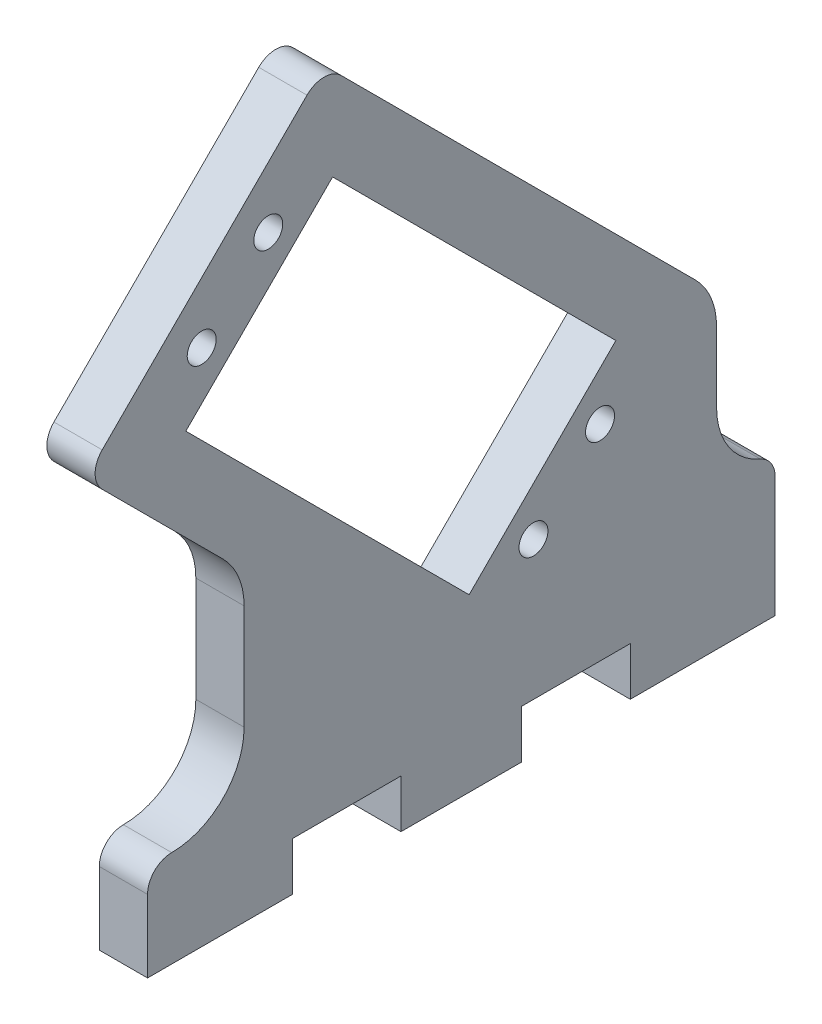
ISO-10303-21;
HEADER;
FILE_DESCRIPTION(('STEP AP214'),'2;1');
FILE_NAME('part.step','',(''),(''),'','','');
FILE_SCHEMA(('AUTOMOTIVE_DESIGN { 1 0 10303 214 1 1 1 1 }'));
ENDSEC;
DATA;
#1=APPLICATION_CONTEXT('core data for automotive mechanical design processes');
#2=APPLICATION_PROTOCOL_DEFINITION('international standard','automotive_design',2000,#1);
#3=PRODUCT_CONTEXT('',#1,'mechanical');
#4=PRODUCT('Part','Part','',(#3));
#5=PRODUCT_RELATED_PRODUCT_CATEGORY('part','',(#4));
#6=PRODUCT_DEFINITION_FORMATION('','',#4);
#7=PRODUCT_DEFINITION_CONTEXT('part definition',#1,'design');
#8=PRODUCT_DEFINITION('design','',#6,#7);
#9=PRODUCT_DEFINITION_SHAPE('','',#8);
#10=(LENGTH_UNIT() NAMED_UNIT(*) SI_UNIT(.MILLI.,.METRE.));
#11=(NAMED_UNIT(*) PLANE_ANGLE_UNIT() SI_UNIT($,.RADIAN.));
#12=(NAMED_UNIT(*) SI_UNIT($,.STERADIAN.) SOLID_ANGLE_UNIT());
#13=UNCERTAINTY_MEASURE_WITH_UNIT(LENGTH_MEASURE(1.E-05),#10,'distance_accuracy_value','');
#14=(GEOMETRIC_REPRESENTATION_CONTEXT(3) GLOBAL_UNCERTAINTY_ASSIGNED_CONTEXT((#13)) GLOBAL_UNIT_ASSIGNED_CONTEXT((#10,
#11,#12)) REPRESENTATION_CONTEXT('',''));
#15=CARTESIAN_POINT('',(0.,0.,0.));
#16=DIRECTION('',(0.,0.,1.));
#17=DIRECTION('',(1.,0.,0.));
#18=AXIS2_PLACEMENT_3D('',#15,#16,#17);
#19=CARTESIAN_POINT('',(0.,0.,0.));
#20=DIRECTION('',(1.,0.,0.));
#21=DIRECTION('',(0.,0.,-1.));
#22=AXIS2_PLACEMENT_3D('',#19,#20,#21);
#23=PLANE('',#22);
#24=CARTESIAN_POINT('',(0.,26.2644507754514,-46.866522151183));
#25=DIRECTION('',(-1.,0.,0.));
#26=DIRECTION('',(0.,0.,1.));
#27=AXIS2_PLACEMENT_3D('',#24,#25,#26);
#28=CIRCLE('',#27,1.5);
#29=CARTESIAN_POINT('',(0.,26.2644507754514,-45.366522151183));
#30=VERTEX_POINT('',#29);
#31=EDGE_CURVE('E244',#30,#30,#28,.F.);
#32=ORIENTED_EDGE('',*,*,#31,.T.);
#33=EDGE_LOOP('',(#32));
#34=FACE_BOUND('',#33,.T.);
#35=CARTESIAN_POINT('',(0.,53.7355492245485,-5.60684146894776));
#36=DIRECTION('',(-1.,0.,0.));
#37=DIRECTION('',(0.,0.,1.));
#38=AXIS2_PLACEMENT_3D('',#35,#36,#37);
#39=CIRCLE('',#38,1.50000000000023);
#40=CARTESIAN_POINT('',(0.,53.7355492245485,-4.10684146894753));
#41=VERTEX_POINT('',#40);
#42=EDGE_CURVE('E486',#41,#41,#39,.F.);
#43=ORIENTED_EDGE('',*,*,#42,.T.);
#44=EDGE_LOOP('',(#43));
#45=FACE_BOUND('',#44,.T.);
#46=CARTESIAN_POINT('',(0.,60.6298403411174,-12.5011325855165));
#47=DIRECTION('',(-1.,0.,0.));
#48=DIRECTION('',(0.,0.,1.));
#49=AXIS2_PLACEMENT_3D('',#46,#47,#48);
#50=CIRCLE('',#49,1.49999999999996);
#51=CARTESIAN_POINT('',(0.,60.6298403411174,-11.0011325855166));
#52=VERTEX_POINT('',#51);
#53=EDGE_CURVE('E249',#52,#52,#50,.F.);
#54=ORIENTED_EDGE('',*,*,#53,.T.);
#55=EDGE_LOOP('',(#54));
#56=FACE_BOUND('',#55,.T.);
#57=CARTESIAN_POINT('',(0.,28.9384469938513,-51.4403704399442));
#58=DIRECTION('',(-1.,0.,0.));
#59=DIRECTION('',(0.,0.,1.));
#60=AXIS2_PLACEMENT_3D('',#57,#58,#59);
#61=CIRCLE('',#60,7.5);
#62=CARTESIAN_POINT('',(0.,28.9384469938508,-58.9403704399442));
#63=VERTEX_POINT('',#62);
#64=CARTESIAN_POINT('',(0.,34.2417478527504,-56.7436712988433));
#65=VERTEX_POINT('',#64);
#66=EDGE_CURVE('E391',#63,#65,#61,.F.);
#67=ORIENTED_EDGE('',*,*,#66,.F.);
#68=DIRECTION('',(0.,-1.,0.));
#69=VECTOR('',#68,1.);
#70=CARTESIAN_POINT('',(0.,15.,-58.9403704399433));
#71=LINE('',#70,#69);
#72=CARTESIAN_POINT('',(0.,21.6909455876978,-58.9403704399437));
#73=VERTEX_POINT('',#72);
#74=EDGE_CURVE('E120',#63,#73,#71,.T.);
#75=ORIENTED_EDGE('',*,*,#74,.T.);
#76=CARTESIAN_POINT('',(0.,21.6909455876976,-66.4403704399437));
#77=DIRECTION('',(-1.,0.,0.));
#78=DIRECTION('',(0.,0.,1.));
#79=AXIS2_PLACEMENT_3D('',#76,#77,#78);
#80=CIRCLE('',#79,7.5);
#81=CARTESIAN_POINT('',(0.,14.7977363969244,-63.4850926099859));
#82=VERTEX_POINT('',#81);
#83=EDGE_CURVE('E250',#73,#82,#80,.F.);
#84=ORIENTED_EDGE('',*,*,#83,.T.);
#85=CARTESIAN_POINT('',(0.,12.5,-62.5));
#86=DIRECTION('',(-1.,0.,0.));
#87=DIRECTION('',(0.,0.,1.));
#88=AXIS2_PLACEMENT_3D('',#85,#86,#87);
#89=CIRCLE('',#88,2.5);
#90=CARTESIAN_POINT('',(0.,12.5,-65.));
#91=VERTEX_POINT('',#90);
#92=EDGE_CURVE('E256',#91,#82,#89,.F.);
#93=ORIENTED_EDGE('',*,*,#92,.F.);
#94=DIRECTION('',(0.,-1.,0.));
#95=VECTOR('',#94,1.);
#96=CARTESIAN_POINT('',(0.,0.,-65.));
#97=LINE('',#96,#95);
#98=CARTESIAN_POINT('',(0.,0.,-65.));
#99=VERTEX_POINT('',#98);
#100=EDGE_CURVE('E259',#91,#99,#97,.T.);
#101=ORIENTED_EDGE('',*,*,#100,.T.);
#102=DIRECTION('',(0.,0.,1.));
#103=VECTOR('',#102,1.);
#104=CARTESIAN_POINT('',(0.,0.,-50.));
#105=LINE('',#104,#103);
#106=CARTESIAN_POINT('',(0.,0.,-50.));
#107=VERTEX_POINT('',#106);
#108=EDGE_CURVE('E260',#99,#107,#105,.T.);
#109=ORIENTED_EDGE('',*,*,#108,.T.);
#110=DIRECTION('',(0.,1.,0.));
#111=VECTOR('',#110,1.);
#112=CARTESIAN_POINT('',(0.,5.,-50.));
#113=LINE('',#112,#111);
#114=CARTESIAN_POINT('',(0.,5.,-50.));
#115=VERTEX_POINT('',#114);
#116=EDGE_CURVE('E272',#107,#115,#113,.T.);
#117=ORIENTED_EDGE('',*,*,#116,.T.);
#118=DIRECTION('',(0.,0.,1.));
#119=VECTOR('',#118,1.);
#120=CARTESIAN_POINT('',(0.,5.,-38.75));
#121=LINE('',#120,#119);
#122=CARTESIAN_POINT('',(0.,5.,-38.75));
#123=VERTEX_POINT('',#122);
#124=EDGE_CURVE('E282',#115,#123,#121,.T.);
#125=ORIENTED_EDGE('',*,*,#124,.T.);
#126=DIRECTION('',(0.,1.,0.));
#127=VECTOR('',#126,1.);
#128=CARTESIAN_POINT('',(0.,0.,-38.75));
#129=LINE('',#128,#127);
#130=CARTESIAN_POINT('',(0.,0.,-38.75));
#131=VERTEX_POINT('',#130);
#132=EDGE_CURVE('E292',#123,#131,#129,.F.);
#133=ORIENTED_EDGE('',*,*,#132,.T.);
#134=DIRECTION('',(0.,0.,1.));
#135=VECTOR('',#134,1.);
#136=CARTESIAN_POINT('',(0.,0.,-26.25));
#137=LINE('',#136,#135);
#138=CARTESIAN_POINT('',(0.,0.,-26.25));
#139=VERTEX_POINT('',#138);
#140=EDGE_CURVE('E302',#131,#139,#137,.T.);
#141=ORIENTED_EDGE('',*,*,#140,.T.);
#142=DIRECTION('',(0.,1.,0.));
#143=VECTOR('',#142,1.);
#144=CARTESIAN_POINT('',(0.,5.,-26.25));
#145=LINE('',#144,#143);
#146=CARTESIAN_POINT('',(0.,5.,-26.25));
#147=VERTEX_POINT('',#146);
#148=EDGE_CURVE('E312',#139,#147,#145,.T.);
#149=ORIENTED_EDGE('',*,*,#148,.T.);
#150=DIRECTION('',(0.,0.,1.));
#151=VECTOR('',#150,1.);
#152=CARTESIAN_POINT('',(0.,5.,-15.));
#153=LINE('',#152,#151);
#154=CARTESIAN_POINT('',(0.,5.,-15.));
#155=VERTEX_POINT('',#154);
#156=EDGE_CURVE('E322',#147,#155,#153,.T.);
#157=ORIENTED_EDGE('',*,*,#156,.T.);
#158=DIRECTION('',(0.,1.,0.));
#159=VECTOR('',#158,1.);
#160=CARTESIAN_POINT('',(0.,0.,-15.));
#161=LINE('',#160,#159);
#162=CARTESIAN_POINT('',(0.,0.,-15.));
#163=VERTEX_POINT('',#162);
#164=EDGE_CURVE('E332',#155,#163,#161,.F.);
#165=ORIENTED_EDGE('',*,*,#164,.T.);
#166=DIRECTION('',(0.,0.,1.));
#167=VECTOR('',#166,1.);
#168=CARTESIAN_POINT('',(0.,0.,0.));
#169=LINE('',#168,#167);
#170=CARTESIAN_POINT('',(0.,0.,0.));
#171=VERTEX_POINT('',#170);
#172=EDGE_CURVE('E342',#163,#171,#169,.T.);
#173=ORIENTED_EDGE('',*,*,#172,.T.);
#174=DIRECTION('',(0.,1.,0.));
#175=VECTOR('',#174,1.);
#176=CARTESIAN_POINT('',(0.,10.,0.));
#177=LINE('',#176,#175);
#178=CARTESIAN_POINT('',(0.,7.5,0.));
#179=VERTEX_POINT('',#178);
#180=EDGE_CURVE('E356',#171,#179,#177,.T.);
#181=ORIENTED_EDGE('',*,*,#180,.T.);
#182=CARTESIAN_POINT('',(0.,7.5,-2.5));
#183=DIRECTION('',(-1.,0.,0.));
#184=DIRECTION('',(0.,0.,1.));
#185=AXIS2_PLACEMENT_3D('',#182,#183,#184);
#186=CIRCLE('',#185,2.5);
#187=CARTESIAN_POINT('',(0.,10.,-2.5));
#188=VERTEX_POINT('',#187);
#189=EDGE_CURVE('E360',#188,#179,#186,.F.);
#190=ORIENTED_EDGE('',*,*,#189,.F.);
#191=CARTESIAN_POINT('',(0.,17.5,-2.5));
#192=DIRECTION('',(1.,0.,0.));
#193=DIRECTION('',(0.,0.,-1.));
#194=AXIS2_PLACEMENT_3D('',#191,#192,#193);
#195=CIRCLE('',#194,7.5);
#196=CARTESIAN_POINT('',(0.,17.5,-10.));
#197=VERTEX_POINT('',#196);
#198=EDGE_CURVE('E363',#188,#197,#195,.T.);
#199=ORIENTED_EDGE('',*,*,#198,.T.);
#200=DIRECTION('',(0.,1.,0.));
#201=VECTOR('',#200,1.);
#202=CARTESIAN_POINT('',(0.,31.4879444685351,-10.));
#203=LINE('',#202,#201);
#204=CARTESIAN_POINT('',(0.,28.3813427507368,-10.));
#205=VERTEX_POINT('',#204);
#206=EDGE_CURVE('E366',#197,#205,#203,.T.);
#207=ORIENTED_EDGE('',*,*,#206,.T.);
#208=CARTESIAN_POINT('',(0.,28.3813427507368,-2.5));
#209=DIRECTION('',(1.,0.,0.));
#210=DIRECTION('',(0.,0.,-1.));
#211=AXIS2_PLACEMENT_3D('',#208,#209,#210);
#212=CIRCLE('',#211,7.5);
#213=CARTESIAN_POINT('',(0.,33.684643609636,-7.80330085889907));
#214=VERTEX_POINT('',#213);
#215=EDGE_CURVE('E369',#205,#214,#212,.T.);
#216=ORIENTED_EDGE('',*,*,#215,.T.);
#217=DIRECTION('',(0.,0.707106781186542,0.707106781186553));
#218=VECTOR('',#217,1.);
#219=CARTESIAN_POINT('',(0.,47.9549512883462,6.46700681981134));
#220=LINE('',#219,#218);
#221=CARTESIAN_POINT('',(0.,46.1871843353798,4.69923986684496));
#222=VERTEX_POINT('',#221);
#223=EDGE_CURVE('E373',#214,#222,#220,.T.);
#224=ORIENTED_EDGE('',*,*,#223,.T.);
#225=CARTESIAN_POINT('',(0.,47.9549512883462,2.9314729138786));
#226=DIRECTION('',(-1.,0.,0.));
#227=DIRECTION('',(0.,0.,1.));
#228=AXIS2_PLACEMENT_3D('',#225,#226,#227);
#229=CIRCLE('',#228,2.5);
#230=CARTESIAN_POINT('',(0.,49.7227182413126,4.69923986684498));
#231=VERTEX_POINT('',#230);
#232=EDGE_CURVE('E374',#231,#222,#229,.F.);
#233=ORIENTED_EDGE('',*,*,#232,.F.);
#234=DIRECTION('',(0.,0.707106781186553,-0.707106781186542));
#235=VECTOR('',#234,1.);
#236=CARTESIAN_POINT('',(0.,47.9549512883462,6.46700681981134));
#237=LINE('',#236,#235);
#238=CARTESIAN_POINT('',(0.,70.9359216769091,-16.5139635687513));
#239=VERTEX_POINT('',#238);
#240=EDGE_CURVE('E380',#231,#239,#237,.T.);
#241=ORIENTED_EDGE('',*,*,#240,.T.);
#242=CARTESIAN_POINT('',(0.,69.1681547239428,-18.2817305217177));
#243=DIRECTION('',(-1.,0.,0.));
#244=DIRECTION('',(0.,0.,1.));
#245=AXIS2_PLACEMENT_3D('',#242,#243,#244);
#246=CIRCLE('',#245,2.5);
#247=CARTESIAN_POINT('',(0.,70.9359216769092,-20.049497474684));
#248=VERTEX_POINT('',#247);
#249=EDGE_CURVE('E384',#248,#239,#246,.F.);
#250=ORIENTED_EDGE('',*,*,#249,.F.);
#251=DIRECTION('',(0.,-0.707106781186542,-0.707106781186553));
#252=VECTOR('',#251,1.);
#253=CARTESIAN_POINT('',(0.,72.7036886298755,-18.2817305217176));
#254=LINE('',#253,#252);
#255=EDGE_CURVE('E387',#248,#65,#254,.T.);
#256=ORIENTED_EDGE('',*,*,#255,.T.);
#257=EDGE_LOOP('',(#67,#75,#84,#93,#101,#109,#117,#125,#133,#141,#149,#157,#165,#173,#181,#190,
#199,#207,#216,#224,#233,#241,#250,#256));
#258=FACE_BOUND('',#257,.T.);
#259=DIRECTION('',(0.,0.707106781186542,0.707106781186553));
#260=VECTOR('',#259,1.);
#261=CARTESIAN_POINT('',(0.,47.0710678118649,-3.96281820269029));
#262=LINE('',#261,#260);
#263=CARTESIAN_POINT('',(0.,17.7261363926233,-33.3077496219322));
#264=VERTEX_POINT('',#263);
#265=CARTESIAN_POINT('',(0.,47.0710678118649,-3.96281820269029));
#266=VERTEX_POINT('',#265);
#267=EDGE_CURVE('E130',#264,#266,#262,.T.);
#268=ORIENTED_EDGE('',*,*,#267,.F.);
#269=DIRECTION('',(0.,-0.707106781186553,0.707106781186542));
#270=VECTOR('',#269,1.);
#271=CARTESIAN_POINT('',(0.,17.7261363926233,-33.3077496219322));
#272=LINE('',#271,#270);
#273=CARTESIAN_POINT('',(0.,32.9289321881342,-48.5105454174429));
#274=VERTEX_POINT('',#273);
#275=EDGE_CURVE('E395',#274,#264,#272,.T.);
#276=ORIENTED_EDGE('',*,*,#275,.F.);
#277=DIRECTION('',(0.,-0.707106781186542,-0.707106781186553));
#278=VECTOR('',#277,1.);
#279=CARTESIAN_POINT('',(0.,62.2738636073757,-19.1656139982009));
#280=LINE('',#279,#278);
#281=CARTESIAN_POINT('',(0.,62.2738636073757,-19.1656139982009));
#282=VERTEX_POINT('',#281);
#283=EDGE_CURVE('E225',#282,#274,#280,.T.);
#284=ORIENTED_EDGE('',*,*,#283,.F.);
#285=DIRECTION('',(0.,0.707106781186553,-0.707106781186542));
#286=VECTOR('',#285,1.);
#287=CARTESIAN_POINT('',(0.,47.0710678118649,-3.96281820269029));
#288=LINE('',#287,#286);
#289=EDGE_CURVE('E226',#266,#282,#288,.T.);
#290=ORIENTED_EDGE('',*,*,#289,.F.);
#291=EDGE_LOOP('',(#268,#276,#284,#290));
#292=FACE_BOUND('',#291,.T.);
#293=CARTESIAN_POINT('',(0.,19.3701596588826,-39.9722310346142));
#294=DIRECTION('',(-1.,0.,0.));
#295=DIRECTION('',(0.,0.,1.));
#296=AXIS2_PLACEMENT_3D('',#293,#294,#295);
#297=CIRCLE('',#296,1.50000000000002);
#298=CARTESIAN_POINT('',(0.,19.3701596588826,-38.4722310346142));
#299=VERTEX_POINT('',#298);
#300=EDGE_CURVE('E20',#299,#299,#297,.F.);
#301=ORIENTED_EDGE('',*,*,#300,.T.);
#302=EDGE_LOOP('',(#301));
#303=FACE_BOUND('',#302,.T.);
#304=ADVANCED_FACE('F17',(#34,#45,#56,#258,#292,#303),#23,.F.);
#305=CARTESIAN_POINT('',(5.,19.3701596588826,-39.9722310346142));
#306=DIRECTION('',(-1.,0.,0.));
#307=DIRECTION('',(0.,0.,1.));
#308=AXIS2_PLACEMENT_3D('',#305,#306,#307);
#309=CYLINDRICAL_SURFACE('',#308,1.50000000000002);
#310=CARTESIAN_POINT('',(5.,19.3701596588826,-39.9722310346142));
#311=DIRECTION('',(-1.,0.,0.));
#312=DIRECTION('',(0.,0.,1.));
#313=AXIS2_PLACEMENT_3D('',#310,#311,#312);
#314=CIRCLE('',#313,1.50000000000002);
#315=CARTESIAN_POINT('',(5.,19.3701596588826,-38.4722310346142));
#316=VERTEX_POINT('',#315);
#317=EDGE_CURVE('E241',#316,#316,#314,.T.);
#318=ORIENTED_EDGE('',*,*,#317,.F.);
#319=EDGE_LOOP('',(#318));
#320=FACE_BOUND('',#319,.T.);
#321=ORIENTED_EDGE('',*,*,#300,.F.);
#322=EDGE_LOOP('',(#321));
#323=FACE_BOUND('',#322,.T.);
#324=ADVANCED_FACE('F521',(#320,#323),#309,.F.);
#325=CARTESIAN_POINT('',(5.,47.0710678118649,-3.96281820269029));
#326=DIRECTION('',(0.,0.707106781186553,-0.707106781186542));
#327=DIRECTION('',(0.,0.707106781186542,0.707106781186553));
#328=AXIS2_PLACEMENT_3D('',#325,#326,#327);
#329=PLANE('',#328);
#330=DIRECTION('',(0.,0.707106781186543,0.707106781186552));
#331=VECTOR('',#330,1.);
#332=CARTESIAN_POINT('',(5.,17.7261363926233,-33.3077496219322));
#333=LINE('',#332,#331);
#334=CARTESIAN_POINT('',(5.,17.7261363926233,-33.3077496219322));
#335=VERTEX_POINT('',#334);
#336=CARTESIAN_POINT('',(5.,47.0710678118649,-3.96281820269029));
#337=VERTEX_POINT('',#336);
#338=EDGE_CURVE('E221',#335,#337,#333,.T.);
#339=ORIENTED_EDGE('',*,*,#338,.F.);
#340=DIRECTION('',(1.,0.,0.));
#341=VECTOR('',#340,1.);
#342=CARTESIAN_POINT('',(5.,17.7261363926233,-33.3077496219322));
#343=LINE('',#342,#341);
#344=EDGE_CURVE('E393',#264,#335,#343,.T.);
#345=ORIENTED_EDGE('',*,*,#344,.F.);
#346=ORIENTED_EDGE('',*,*,#267,.T.);
#347=DIRECTION('',(1.,0.,0.));
#348=VECTOR('',#347,1.);
#349=CARTESIAN_POINT('',(5.,47.0710678118649,-3.96281820269029));
#350=LINE('',#349,#348);
#351=EDGE_CURVE('E217',#337,#266,#350,.F.);
#352=ORIENTED_EDGE('',*,*,#351,.F.);
#353=EDGE_LOOP('',(#339,#345,#346,#352));
#354=FACE_BOUND('',#353,.T.);
#355=ADVANCED_FACE('F219',(#354),#329,.T.);
#356=CARTESIAN_POINT('',(5.,47.0710678118649,-3.96281820269029));
#357=DIRECTION('',(0.,-0.707106781186542,-0.707106781186553));
#358=DIRECTION('',(0.,0.707106781186553,-0.707106781186542));
#359=AXIS2_PLACEMENT_3D('',#356,#357,#358);
#360=PLANE('',#359);
#361=DIRECTION('',(0.,0.707106781186553,-0.707106781186542));
#362=VECTOR('',#361,1.);
#363=CARTESIAN_POINT('',(5.,47.0710678118649,-3.96281820269029));
#364=LINE('',#363,#362);
#365=CARTESIAN_POINT('',(5.,62.2738636073757,-19.1656139982009));
#366=VERTEX_POINT('',#365);
#367=EDGE_CURVE('E229',#337,#366,#364,.T.);
#368=ORIENTED_EDGE('',*,*,#367,.F.);
#369=ORIENTED_EDGE('',*,*,#351,.T.);
#370=ORIENTED_EDGE('',*,*,#289,.T.);
#371=DIRECTION('',(1.,0.,0.));
#372=VECTOR('',#371,1.);
#373=CARTESIAN_POINT('',(5.,62.2738636073757,-19.1656139982009));
#374=LINE('',#373,#372);
#375=EDGE_CURVE('E232',#366,#282,#374,.F.);
#376=ORIENTED_EDGE('',*,*,#375,.F.);
#377=EDGE_LOOP('',(#368,#369,#370,#376));
#378=FACE_BOUND('',#377,.T.);
#379=ADVANCED_FACE('F230',(#378),#360,.T.);
#380=CARTESIAN_POINT('',(5.,62.2738636073757,-19.1656139982009));
#381=DIRECTION('',(0.,-0.707106781186553,0.707106781186542));
#382=DIRECTION('',(0.,-0.707106781186542,-0.707106781186553));
#383=AXIS2_PLACEMENT_3D('',#380,#381,#382);
#384=PLANE('',#383);
#385=DIRECTION('',(0.,-0.707106781186542,-0.707106781186552));
#386=VECTOR('',#385,1.);
#387=CARTESIAN_POINT('',(5.,62.2738636073757,-19.1656139982009));
#388=LINE('',#387,#386);
#389=CARTESIAN_POINT('',(5.,32.9289321881342,-48.5105454174429));
#390=VERTEX_POINT('',#389);
#391=EDGE_CURVE('E235',#366,#390,#388,.T.);
#392=ORIENTED_EDGE('',*,*,#391,.F.);
#393=ORIENTED_EDGE('',*,*,#375,.T.);
#394=ORIENTED_EDGE('',*,*,#283,.T.);
#395=DIRECTION('',(1.,0.,0.));
#396=VECTOR('',#395,1.);
#397=CARTESIAN_POINT('',(5.,32.9289321881342,-48.5105454174429));
#398=LINE('',#397,#396);
#399=EDGE_CURVE('E207',#390,#274,#398,.F.);
#400=ORIENTED_EDGE('',*,*,#399,.F.);
#401=EDGE_LOOP('',(#392,#393,#394,#400));
#402=FACE_BOUND('',#401,.T.);
#403=ADVANCED_FACE('F516',(#402),#384,.T.);
#404=CARTESIAN_POINT('',(5.,17.7261363926233,-33.3077496219322));
#405=DIRECTION('',(0.,0.707106781186542,0.707106781186553));
#406=DIRECTION('',(0.,-0.707106781186553,0.707106781186542));
#407=AXIS2_PLACEMENT_3D('',#404,#405,#406);
#408=PLANE('',#407);
#409=DIRECTION('',(0.,-0.707106781186553,0.707106781186542));
#410=VECTOR('',#409,1.);
#411=CARTESIAN_POINT('',(5.,32.9289321881342,-48.5105454174429));
#412=LINE('',#411,#410);
#413=EDGE_CURVE('E240',#390,#335,#412,.T.);
#414=ORIENTED_EDGE('',*,*,#413,.F.);
#415=ORIENTED_EDGE('',*,*,#399,.T.);
#416=ORIENTED_EDGE('',*,*,#275,.T.);
#417=ORIENTED_EDGE('',*,*,#344,.T.);
#418=EDGE_LOOP('',(#414,#415,#416,#417));
#419=FACE_BOUND('',#418,.T.);
#420=ADVANCED_FACE('F518',(#419),#408,.T.);
#421=CARTESIAN_POINT('',(5.,15.,-58.9403704399433));
#422=DIRECTION('',(0.,0.,1.));
#423=DIRECTION('',(0.,-1.,0.));
#424=AXIS2_PLACEMENT_3D('',#421,#422,#423);
#425=PLANE('',#424);
#426=DIRECTION('',(-1.,0.,0.));
#427=VECTOR('',#426,1.);
#428=CARTESIAN_POINT('',(5.,28.9384469938508,-58.9403704399442));
#429=LINE('',#428,#427);
#430=CARTESIAN_POINT('',(5.,28.9384469938511,-58.9403704399439));
#431=VERTEX_POINT('',#430);
#432=EDGE_CURVE('E388',#431,#63,#429,.T.);
#433=ORIENTED_EDGE('',*,*,#432,.F.);
#434=DIRECTION('',(0.,1.,0.));
#435=VECTOR('',#434,1.);
#436=CARTESIAN_POINT('',(5.,0.,-58.9403704399437));
#437=LINE('',#436,#435);
#438=CARTESIAN_POINT('',(5.,21.6909455876976,-58.9403704399437));
#439=VERTEX_POINT('',#438);
#440=EDGE_CURVE('E198',#439,#431,#437,.T.);
#441=ORIENTED_EDGE('',*,*,#440,.F.);
#442=DIRECTION('',(-1.,0.,0.));
#443=VECTOR('',#442,1.);
#444=CARTESIAN_POINT('',(5.,21.6909455876976,-58.9403704399437));
#445=LINE('',#444,#443);
#446=EDGE_CURVE('E251',#439,#73,#445,.T.);
#447=ORIENTED_EDGE('',*,*,#446,.T.);
#448=ORIENTED_EDGE('',*,*,#74,.F.);
#449=EDGE_LOOP('',(#433,#441,#447,#448));
#450=FACE_BOUND('',#449,.T.);
#451=ADVANCED_FACE('F640',(#450),#425,.F.);
#452=CARTESIAN_POINT('',(5.,28.9384469938513,-51.4403704399442));
#453=DIRECTION('',(-1.,0.,0.));
#454=DIRECTION('',(0.,0.,1.));
#455=AXIS2_PLACEMENT_3D('',#452,#453,#454);
#456=CYLINDRICAL_SURFACE('',#455,7.5);
#457=ORIENTED_EDGE('',*,*,#66,.T.);
#458=DIRECTION('',(1.,0.,0.));
#459=VECTOR('',#458,1.);
#460=CARTESIAN_POINT('',(5.,34.2417478527504,-56.7436712988433));
#461=LINE('',#460,#459);
#462=CARTESIAN_POINT('',(5.,34.2417478527504,-56.7436712988433));
#463=VERTEX_POINT('',#462);
#464=EDGE_CURVE('E385',#65,#463,#461,.T.);
#465=ORIENTED_EDGE('',*,*,#464,.T.);
#466=CARTESIAN_POINT('',(5.,28.9384469938513,-51.4403704399442));
#467=DIRECTION('',(-1.,0.,0.));
#468=DIRECTION('',(0.,0.,1.));
#469=AXIS2_PLACEMENT_3D('',#466,#467,#468);
#470=CIRCLE('',#469,7.5);
#471=EDGE_CURVE('E481',#431,#463,#470,.F.);
#472=ORIENTED_EDGE('',*,*,#471,.F.);
#473=ORIENTED_EDGE('',*,*,#432,.T.);
#474=EDGE_LOOP('',(#457,#465,#472,#473));
#475=FACE_BOUND('',#474,.T.);
#476=ADVANCED_FACE('F502',(#475),#456,.T.);
#477=CARTESIAN_POINT('',(5.,72.7036886298755,-18.2817305217176));
#478=DIRECTION('',(0.,-0.707106781186553,0.707106781186542));
#479=DIRECTION('',(0.,-0.707106781186542,-0.707106781186553));
#480=AXIS2_PLACEMENT_3D('',#477,#478,#479);
#481=PLANE('',#480);
#482=ORIENTED_EDGE('',*,*,#464,.F.);
#483=ORIENTED_EDGE('',*,*,#255,.F.);
#484=DIRECTION('',(-1.,0.,0.));
#485=VECTOR('',#484,1.);
#486=CARTESIAN_POINT('',(5.,70.9359216769092,-20.049497474684));
#487=LINE('',#486,#485);
#488=CARTESIAN_POINT('',(5.,70.9359216769092,-20.049497474684));
#489=VERTEX_POINT('',#488);
#490=EDGE_CURVE('E381',#489,#248,#487,.T.);
#491=ORIENTED_EDGE('',*,*,#490,.F.);
#492=DIRECTION('',(0.,0.707106781186543,0.707106781186553));
#493=VECTOR('',#492,1.);
#494=CARTESIAN_POINT('',(5.,34.2417478527504,-56.7436712988433));
#495=LINE('',#494,#493);
#496=EDGE_CURVE('E480',#463,#489,#495,.T.);
#497=ORIENTED_EDGE('',*,*,#496,.F.);
#498=EDGE_LOOP('',(#482,#483,#491,#497));
#499=FACE_BOUND('',#498,.T.);
#500=ADVANCED_FACE('F507',(#499),#481,.F.);
#501=CARTESIAN_POINT('',(5.,69.1681547239428,-18.2817305217177));
#502=DIRECTION('',(-1.,0.,0.));
#503=DIRECTION('',(0.,0.,1.));
#504=AXIS2_PLACEMENT_3D('',#501,#502,#503);
#505=CYLINDRICAL_SURFACE('',#504,2.5);
#506=ORIENTED_EDGE('',*,*,#249,.T.);
#507=DIRECTION('',(1.,0.,0.));
#508=VECTOR('',#507,1.);
#509=CARTESIAN_POINT('',(5.,70.9359216769091,-16.5139635687513));
#510=LINE('',#509,#508);
#511=CARTESIAN_POINT('',(5.,70.9359216769091,-16.5139635687513));
#512=VERTEX_POINT('',#511);
#513=EDGE_CURVE('E378',#239,#512,#510,.T.);
#514=ORIENTED_EDGE('',*,*,#513,.T.);
#515=CARTESIAN_POINT('',(5.,69.1681547239428,-18.2817305217177));
#516=DIRECTION('',(-1.,0.,0.));
#517=DIRECTION('',(0.,0.,1.));
#518=AXIS2_PLACEMENT_3D('',#515,#516,#517);
#519=CIRCLE('',#518,2.5);
#520=EDGE_CURVE('E477',#489,#512,#519,.F.);
#521=ORIENTED_EDGE('',*,*,#520,.F.);
#522=ORIENTED_EDGE('',*,*,#490,.T.);
#523=EDGE_LOOP('',(#506,#514,#521,#522));
#524=FACE_BOUND('',#523,.T.);
#525=ADVANCED_FACE('F631',(#524),#505,.T.);
#526=CARTESIAN_POINT('',(5.,47.9549512883462,6.46700681981134));
#527=DIRECTION('',(0.,-0.707106781186542,-0.707106781186553));
#528=DIRECTION('',(0.,0.707106781186553,-0.707106781186542));
#529=AXIS2_PLACEMENT_3D('',#526,#527,#528);
#530=PLANE('',#529);
#531=ORIENTED_EDGE('',*,*,#513,.F.);
#532=ORIENTED_EDGE('',*,*,#240,.F.);
#533=DIRECTION('',(-1.,0.,0.));
#534=VECTOR('',#533,1.);
#535=CARTESIAN_POINT('',(5.,49.7227182413126,4.69923986684498));
#536=LINE('',#535,#534);
#537=CARTESIAN_POINT('',(5.,49.7227182413126,4.69923986684498));
#538=VERTEX_POINT('',#537);
#539=EDGE_CURVE('E375',#538,#231,#536,.T.);
#540=ORIENTED_EDGE('',*,*,#539,.F.);
#541=DIRECTION('',(0.,-0.707106781186553,0.707106781186542));
#542=VECTOR('',#541,1.);
#543=CARTESIAN_POINT('',(5.,70.9359216769091,-16.5139635687513));
#544=LINE('',#543,#542);
#545=EDGE_CURVE('E476',#512,#538,#544,.T.);
#546=ORIENTED_EDGE('',*,*,#545,.F.);
#547=EDGE_LOOP('',(#531,#532,#540,#546));
#548=FACE_BOUND('',#547,.T.);
#549=ADVANCED_FACE('F627',(#548),#530,.F.);
#550=CARTESIAN_POINT('',(5.,47.9549512883462,2.9314729138786));
#551=DIRECTION('',(-1.,0.,0.));
#552=DIRECTION('',(0.,0.,1.));
#553=AXIS2_PLACEMENT_3D('',#550,#551,#552);
#554=CYLINDRICAL_SURFACE('',#553,2.5);
#555=ORIENTED_EDGE('',*,*,#232,.T.);
#556=DIRECTION('',(1.,0.,0.));
#557=VECTOR('',#556,1.);
#558=CARTESIAN_POINT('',(5.,46.1871843353798,4.69923986684496));
#559=LINE('',#558,#557);
#560=CARTESIAN_POINT('',(5.,46.1871843353798,4.69923986684496));
#561=VERTEX_POINT('',#560);
#562=EDGE_CURVE('E370',#222,#561,#559,.T.);
#563=ORIENTED_EDGE('',*,*,#562,.T.);
#564=CARTESIAN_POINT('',(5.,47.9549512883462,2.9314729138786));
#565=DIRECTION('',(-1.,0.,0.));
#566=DIRECTION('',(0.,0.,1.));
#567=AXIS2_PLACEMENT_3D('',#564,#565,#566);
#568=CIRCLE('',#567,2.5);
#569=EDGE_CURVE('E474',#538,#561,#568,.F.);
#570=ORIENTED_EDGE('',*,*,#569,.F.);
#571=ORIENTED_EDGE('',*,*,#539,.T.);
#572=EDGE_LOOP('',(#555,#563,#570,#571));
#573=FACE_BOUND('',#572,.T.);
#574=ADVANCED_FACE('F623',(#573),#554,.T.);
#575=CARTESIAN_POINT('',(5.,47.9549512883462,6.46700681981134));
#576=DIRECTION('',(0.,0.707106781186553,-0.707106781186542));
#577=DIRECTION('',(0.,0.707106781186542,0.707106781186553));
#578=AXIS2_PLACEMENT_3D('',#575,#576,#577);
#579=PLANE('',#578);
#580=DIRECTION('',(1.,0.,0.));
#581=VECTOR('',#580,1.);
#582=CARTESIAN_POINT('',(5.,33.684643609636,-7.80330085889907));
#583=LINE('',#582,#581);
#584=CARTESIAN_POINT('',(5.,33.684643609636,-7.80330085889907));
#585=VERTEX_POINT('',#584);
#586=EDGE_CURVE('E367',#214,#585,#583,.T.);
#587=ORIENTED_EDGE('',*,*,#586,.T.);
#588=DIRECTION('',(0.,-0.707106781186542,-0.707106781186553));
#589=VECTOR('',#588,1.);
#590=CARTESIAN_POINT('',(5.,46.1871843353798,4.69923986684496));
#591=LINE('',#590,#589);
#592=EDGE_CURVE('E473',#561,#585,#591,.T.);
#593=ORIENTED_EDGE('',*,*,#592,.F.);
#594=ORIENTED_EDGE('',*,*,#562,.F.);
#595=ORIENTED_EDGE('',*,*,#223,.F.);
#596=EDGE_LOOP('',(#587,#593,#594,#595));
#597=FACE_BOUND('',#596,.T.);
#598=ADVANCED_FACE('F619',(#597),#579,.F.);
#599=CARTESIAN_POINT('',(5.,28.3813427507368,-2.5));
#600=DIRECTION('',(1.,0.,0.));
#601=DIRECTION('',(0.,0.,-1.));
#602=AXIS2_PLACEMENT_3D('',#599,#600,#601);
#603=CYLINDRICAL_SURFACE('',#602,7.5);
#604=ORIENTED_EDGE('',*,*,#586,.F.);
#605=ORIENTED_EDGE('',*,*,#215,.F.);
#606=DIRECTION('',(-1.,0.,0.));
#607=VECTOR('',#606,1.);
#608=CARTESIAN_POINT('',(5.,28.3813427507368,-10.));
#609=LINE('',#608,#607);
#610=CARTESIAN_POINT('',(5.,28.3813427507368,-10.));
#611=VERTEX_POINT('',#610);
#612=EDGE_CURVE('E364',#205,#611,#609,.F.);
#613=ORIENTED_EDGE('',*,*,#612,.T.);
#614=CARTESIAN_POINT('',(5.,28.3813427507368,-2.5));
#615=DIRECTION('',(1.,0.,0.));
#616=DIRECTION('',(0.,0.,-1.));
#617=AXIS2_PLACEMENT_3D('',#614,#615,#616);
#618=CIRCLE('',#617,7.5);
#619=EDGE_CURVE('E470',#585,#611,#618,.F.);
#620=ORIENTED_EDGE('',*,*,#619,.F.);
#621=EDGE_LOOP('',(#604,#605,#613,#620));
#622=FACE_BOUND('',#621,.T.);
#623=ADVANCED_FACE('F615',(#622),#603,.F.);
#624=CARTESIAN_POINT('',(5.,31.4879444685351,-10.));
#625=DIRECTION('',(0.,0.,-1.));
#626=DIRECTION('',(-1.,0.,0.));
#627=AXIS2_PLACEMENT_3D('',#624,#625,#626);
#628=PLANE('',#627);
#629=DIRECTION('',(1.,0.,0.));
#630=VECTOR('',#629,1.);
#631=CARTESIAN_POINT('',(5.,17.5,-10.));
#632=LINE('',#631,#630);
#633=CARTESIAN_POINT('',(5.,17.5,-10.));
#634=VERTEX_POINT('',#633);
#635=EDGE_CURVE('E361',#197,#634,#632,.T.);
#636=ORIENTED_EDGE('',*,*,#635,.T.);
#637=DIRECTION('',(0.,1.,0.));
#638=VECTOR('',#637,1.);
#639=CARTESIAN_POINT('',(5.,0.,-10.));
#640=LINE('',#639,#638);
#641=EDGE_CURVE('E469',#611,#634,#640,.F.);
#642=ORIENTED_EDGE('',*,*,#641,.F.);
#643=ORIENTED_EDGE('',*,*,#612,.F.);
#644=ORIENTED_EDGE('',*,*,#206,.F.);
#645=EDGE_LOOP('',(#636,#642,#643,#644));
#646=FACE_BOUND('',#645,.T.);
#647=ADVANCED_FACE('F611',(#646),#628,.F.);
#648=CARTESIAN_POINT('',(5.,17.5,-2.5));
#649=DIRECTION('',(1.,0.,0.));
#650=DIRECTION('',(0.,0.,-1.));
#651=AXIS2_PLACEMENT_3D('',#648,#649,#650);
#652=CYLINDRICAL_SURFACE('',#651,7.5);
#653=ORIENTED_EDGE('',*,*,#635,.F.);
#654=ORIENTED_EDGE('',*,*,#198,.F.);
#655=DIRECTION('',(-1.,0.,0.));
#656=VECTOR('',#655,1.);
#657=CARTESIAN_POINT('',(5.,10.,-2.5));
#658=LINE('',#657,#656);
#659=CARTESIAN_POINT('',(5.,10.,-2.5));
#660=VERTEX_POINT('',#659);
#661=EDGE_CURVE('E357',#660,#188,#658,.T.);
#662=ORIENTED_EDGE('',*,*,#661,.F.);
#663=CARTESIAN_POINT('',(5.,17.5,-2.5));
#664=DIRECTION('',(1.,0.,0.));
#665=DIRECTION('',(0.,0.,-1.));
#666=AXIS2_PLACEMENT_3D('',#663,#664,#665);
#667=CIRCLE('',#666,7.5);
#668=EDGE_CURVE('E466',#634,#660,#667,.F.);
#669=ORIENTED_EDGE('',*,*,#668,.F.);
#670=EDGE_LOOP('',(#653,#654,#662,#669));
#671=FACE_BOUND('',#670,.T.);
#672=ADVANCED_FACE('F607',(#671),#652,.F.);
#673=CARTESIAN_POINT('',(5.,7.5,-2.5));
#674=DIRECTION('',(-1.,0.,0.));
#675=DIRECTION('',(0.,0.,1.));
#676=AXIS2_PLACEMENT_3D('',#673,#674,#675);
#677=CYLINDRICAL_SURFACE('',#676,2.5);
#678=ORIENTED_EDGE('',*,*,#189,.T.);
#679=DIRECTION('',(-1.,0.,0.));
#680=VECTOR('',#679,1.);
#681=CARTESIAN_POINT('',(5.,7.5,0.));
#682=LINE('',#681,#680);
#683=CARTESIAN_POINT('',(5.,7.5,0.));
#684=VERTEX_POINT('',#683);
#685=EDGE_CURVE('E352',#179,#684,#682,.F.);
#686=ORIENTED_EDGE('',*,*,#685,.T.);
#687=CARTESIAN_POINT('',(5.,7.5,-2.5));
#688=DIRECTION('',(-1.,0.,0.));
#689=DIRECTION('',(0.,0.,1.));
#690=AXIS2_PLACEMENT_3D('',#687,#688,#689);
#691=CIRCLE('',#690,2.5);
#692=EDGE_CURVE('E463',#660,#684,#691,.F.);
#693=ORIENTED_EDGE('',*,*,#692,.F.);
#694=ORIENTED_EDGE('',*,*,#661,.T.);
#695=EDGE_LOOP('',(#678,#686,#693,#694));
#696=FACE_BOUND('',#695,.T.);
#697=ADVANCED_FACE('F603',(#696),#677,.T.);
#698=CARTESIAN_POINT('',(5.,10.,0.));
#699=DIRECTION('',(0.,0.,-1.));
#700=DIRECTION('',(-1.,0.,0.));
#701=AXIS2_PLACEMENT_3D('',#698,#699,#700);
#702=PLANE('',#701);
#703=ORIENTED_EDGE('',*,*,#685,.F.);
#704=ORIENTED_EDGE('',*,*,#180,.F.);
#705=DIRECTION('',(1.,0.,0.));
#706=VECTOR('',#705,1.);
#707=CARTESIAN_POINT('',(5.,0.,0.));
#708=LINE('',#707,#706);
#709=CARTESIAN_POINT('',(5.,0.,0.));
#710=VERTEX_POINT('',#709);
#711=EDGE_CURVE('E350',#171,#710,#708,.T.);
#712=ORIENTED_EDGE('',*,*,#711,.T.);
#713=DIRECTION('',(0.,1.,0.));
#714=VECTOR('',#713,1.);
#715=CARTESIAN_POINT('',(5.,0.,0.));
#716=LINE('',#715,#714);
#717=EDGE_CURVE('E347',#684,#710,#716,.F.);
#718=ORIENTED_EDGE('',*,*,#717,.F.);
#719=EDGE_LOOP('',(#703,#704,#712,#718));
#720=FACE_BOUND('',#719,.T.);
#721=ADVANCED_FACE('F599',(#720),#702,.F.);
#722=CARTESIAN_POINT('',(5.,0.,0.));
#723=DIRECTION('',(0.,1.,0.));
#724=DIRECTION('',(0.,0.,1.));
#725=AXIS2_PLACEMENT_3D('',#722,#723,#724);
#726=PLANE('',#725);
#727=DIRECTION('',(1.,0.,0.));
#728=VECTOR('',#727,1.);
#729=CARTESIAN_POINT('',(5.,0.,-15.));
#730=LINE('',#729,#728);
#731=CARTESIAN_POINT('',(5.,0.,-15.));
#732=VERTEX_POINT('',#731);
#733=EDGE_CURVE('E340',#163,#732,#730,.T.);
#734=ORIENTED_EDGE('',*,*,#733,.T.);
#735=DIRECTION('',(0.,0.,-1.));
#736=VECTOR('',#735,1.);
#737=CARTESIAN_POINT('',(5.,0.,0.));
#738=LINE('',#737,#736);
#739=EDGE_CURVE('E337',#710,#732,#738,.T.);
#740=ORIENTED_EDGE('',*,*,#739,.F.);
#741=ORIENTED_EDGE('',*,*,#711,.F.);
#742=ORIENTED_EDGE('',*,*,#172,.F.);
#743=EDGE_LOOP('',(#734,#740,#741,#742));
#744=FACE_BOUND('',#743,.T.);
#745=ADVANCED_FACE('F595',(#744),#726,.F.);
#746=CARTESIAN_POINT('',(5.,0.,-15.));
#747=DIRECTION('',(0.,0.,1.));
#748=DIRECTION('',(1.,0.,0.));
#749=AXIS2_PLACEMENT_3D('',#746,#747,#748);
#750=PLANE('',#749);
#751=DIRECTION('',(1.,0.,0.));
#752=VECTOR('',#751,1.);
#753=CARTESIAN_POINT('',(5.,5.,-15.));
#754=LINE('',#753,#752);
#755=CARTESIAN_POINT('',(5.,5.,-15.));
#756=VERTEX_POINT('',#755);
#757=EDGE_CURVE('E330',#155,#756,#754,.T.);
#758=ORIENTED_EDGE('',*,*,#757,.T.);
#759=DIRECTION('',(0.,1.,0.));
#760=VECTOR('',#759,1.);
#761=CARTESIAN_POINT('',(5.,0.,-15.));
#762=LINE('',#761,#760);
#763=EDGE_CURVE('E327',#732,#756,#762,.T.);
#764=ORIENTED_EDGE('',*,*,#763,.F.);
#765=ORIENTED_EDGE('',*,*,#733,.F.);
#766=ORIENTED_EDGE('',*,*,#164,.F.);
#767=EDGE_LOOP('',(#758,#764,#765,#766));
#768=FACE_BOUND('',#767,.T.);
#769=ADVANCED_FACE('F591',(#768),#750,.F.);
#770=CARTESIAN_POINT('',(5.,5.,-15.));
#771=DIRECTION('',(0.,1.,0.));
#772=DIRECTION('',(0.,0.,1.));
#773=AXIS2_PLACEMENT_3D('',#770,#771,#772);
#774=PLANE('',#773);
#775=DIRECTION('',(-1.,0.,0.));
#776=VECTOR('',#775,1.);
#777=CARTESIAN_POINT('',(5.,5.,-26.25));
#778=LINE('',#777,#776);
#779=CARTESIAN_POINT('',(5.,5.,-26.25));
#780=VERTEX_POINT('',#779);
#781=EDGE_CURVE('E320',#147,#780,#778,.F.);
#782=ORIENTED_EDGE('',*,*,#781,.T.);
#783=DIRECTION('',(0.,0.,-1.));
#784=VECTOR('',#783,1.);
#785=CARTESIAN_POINT('',(5.,5.,0.));
#786=LINE('',#785,#784);
#787=EDGE_CURVE('E317',#756,#780,#786,.T.);
#788=ORIENTED_EDGE('',*,*,#787,.F.);
#789=ORIENTED_EDGE('',*,*,#757,.F.);
#790=ORIENTED_EDGE('',*,*,#156,.F.);
#791=EDGE_LOOP('',(#782,#788,#789,#790));
#792=FACE_BOUND('',#791,.T.);
#793=ADVANCED_FACE('F587',(#792),#774,.F.);
#794=CARTESIAN_POINT('',(5.,5.,-26.25));
#795=DIRECTION('',(0.,0.,-1.));
#796=DIRECTION('',(-1.,0.,0.));
#797=AXIS2_PLACEMENT_3D('',#794,#795,#796);
#798=PLANE('',#797);
#799=DIRECTION('',(1.,0.,0.));
#800=VECTOR('',#799,1.);
#801=CARTESIAN_POINT('',(5.,0.,-26.25));
#802=LINE('',#801,#800);
#803=CARTESIAN_POINT('',(5.,0.,-26.25));
#804=VERTEX_POINT('',#803);
#805=EDGE_CURVE('E310',#139,#804,#802,.T.);
#806=ORIENTED_EDGE('',*,*,#805,.T.);
#807=DIRECTION('',(0.,1.,0.));
#808=VECTOR('',#807,1.);
#809=CARTESIAN_POINT('',(5.,0.,-26.25));
#810=LINE('',#809,#808);
#811=EDGE_CURVE('E307',#780,#804,#810,.F.);
#812=ORIENTED_EDGE('',*,*,#811,.F.);
#813=ORIENTED_EDGE('',*,*,#781,.F.);
#814=ORIENTED_EDGE('',*,*,#148,.F.);
#815=EDGE_LOOP('',(#806,#812,#813,#814));
#816=FACE_BOUND('',#815,.T.);
#817=ADVANCED_FACE('F583',(#816),#798,.F.);
#818=CARTESIAN_POINT('',(5.,0.,-26.25));
#819=DIRECTION('',(0.,1.,0.));
#820=DIRECTION('',(0.,0.,1.));
#821=AXIS2_PLACEMENT_3D('',#818,#819,#820);
#822=PLANE('',#821);
#823=DIRECTION('',(1.,0.,0.));
#824=VECTOR('',#823,1.);
#825=CARTESIAN_POINT('',(5.,0.,-38.75));
#826=LINE('',#825,#824);
#827=CARTESIAN_POINT('',(5.,0.,-38.75));
#828=VERTEX_POINT('',#827);
#829=EDGE_CURVE('E300',#131,#828,#826,.T.);
#830=ORIENTED_EDGE('',*,*,#829,.T.);
#831=DIRECTION('',(0.,0.,-1.));
#832=VECTOR('',#831,1.);
#833=CARTESIAN_POINT('',(5.,0.,0.));
#834=LINE('',#833,#832);
#835=EDGE_CURVE('E297',#804,#828,#834,.T.);
#836=ORIENTED_EDGE('',*,*,#835,.F.);
#837=ORIENTED_EDGE('',*,*,#805,.F.);
#838=ORIENTED_EDGE('',*,*,#140,.F.);
#839=EDGE_LOOP('',(#830,#836,#837,#838));
#840=FACE_BOUND('',#839,.T.);
#841=ADVANCED_FACE('F579',(#840),#822,.F.);
#842=CARTESIAN_POINT('',(5.,0.,-38.75));
#843=DIRECTION('',(0.,0.,1.));
#844=DIRECTION('',(1.,0.,0.));
#845=AXIS2_PLACEMENT_3D('',#842,#843,#844);
#846=PLANE('',#845);
#847=DIRECTION('',(1.,0.,0.));
#848=VECTOR('',#847,1.);
#849=CARTESIAN_POINT('',(5.,5.,-38.75));
#850=LINE('',#849,#848);
#851=CARTESIAN_POINT('',(5.,5.,-38.75));
#852=VERTEX_POINT('',#851);
#853=EDGE_CURVE('E290',#123,#852,#850,.T.);
#854=ORIENTED_EDGE('',*,*,#853,.T.);
#855=DIRECTION('',(0.,1.,0.));
#856=VECTOR('',#855,1.);
#857=CARTESIAN_POINT('',(5.,0.,-38.75));
#858=LINE('',#857,#856);
#859=EDGE_CURVE('E287',#828,#852,#858,.T.);
#860=ORIENTED_EDGE('',*,*,#859,.F.);
#861=ORIENTED_EDGE('',*,*,#829,.F.);
#862=ORIENTED_EDGE('',*,*,#132,.F.);
#863=EDGE_LOOP('',(#854,#860,#861,#862));
#864=FACE_BOUND('',#863,.T.);
#865=ADVANCED_FACE('F575',(#864),#846,.F.);
#866=CARTESIAN_POINT('',(5.,5.,-38.75));
#867=DIRECTION('',(0.,1.,0.));
#868=DIRECTION('',(0.,0.,1.));
#869=AXIS2_PLACEMENT_3D('',#866,#867,#868);
#870=PLANE('',#869);
#871=DIRECTION('',(-1.,0.,0.));
#872=VECTOR('',#871,1.);
#873=CARTESIAN_POINT('',(5.,5.,-50.));
#874=LINE('',#873,#872);
#875=CARTESIAN_POINT('',(5.,5.,-50.));
#876=VERTEX_POINT('',#875);
#877=EDGE_CURVE('E280',#115,#876,#874,.F.);
#878=ORIENTED_EDGE('',*,*,#877,.T.);
#879=DIRECTION('',(0.,0.,-1.));
#880=VECTOR('',#879,1.);
#881=CARTESIAN_POINT('',(5.,5.,0.));
#882=LINE('',#881,#880);
#883=EDGE_CURVE('E277',#852,#876,#882,.T.);
#884=ORIENTED_EDGE('',*,*,#883,.F.);
#885=ORIENTED_EDGE('',*,*,#853,.F.);
#886=ORIENTED_EDGE('',*,*,#124,.F.);
#887=EDGE_LOOP('',(#878,#884,#885,#886));
#888=FACE_BOUND('',#887,.T.);
#889=ADVANCED_FACE('F571',(#888),#870,.F.);
#890=CARTESIAN_POINT('',(5.,5.,-50.));
#891=DIRECTION('',(0.,0.,-1.));
#892=DIRECTION('',(-1.,0.,0.));
#893=AXIS2_PLACEMENT_3D('',#890,#891,#892);
#894=PLANE('',#893);
#895=DIRECTION('',(1.,0.,0.));
#896=VECTOR('',#895,1.);
#897=CARTESIAN_POINT('',(5.,0.,-50.));
#898=LINE('',#897,#896);
#899=CARTESIAN_POINT('',(5.,0.,-50.));
#900=VERTEX_POINT('',#899);
#901=EDGE_CURVE('E270',#107,#900,#898,.T.);
#902=ORIENTED_EDGE('',*,*,#901,.T.);
#903=DIRECTION('',(0.,1.,0.));
#904=VECTOR('',#903,1.);
#905=CARTESIAN_POINT('',(5.,0.,-50.));
#906=LINE('',#905,#904);
#907=EDGE_CURVE('E267',#876,#900,#906,.F.);
#908=ORIENTED_EDGE('',*,*,#907,.F.);
#909=ORIENTED_EDGE('',*,*,#877,.F.);
#910=ORIENTED_EDGE('',*,*,#116,.F.);
#911=EDGE_LOOP('',(#902,#908,#909,#910));
#912=FACE_BOUND('',#911,.T.);
#913=ADVANCED_FACE('F567',(#912),#894,.F.);
#914=CARTESIAN_POINT('',(5.,0.,-50.));
#915=DIRECTION('',(0.,1.,0.));
#916=DIRECTION('',(0.,0.,1.));
#917=AXIS2_PLACEMENT_3D('',#914,#915,#916);
#918=PLANE('',#917);
#919=DIRECTION('',(1.,0.,0.));
#920=VECTOR('',#919,1.);
#921=CARTESIAN_POINT('',(5.,0.,-65.));
#922=LINE('',#921,#920);
#923=CARTESIAN_POINT('',(5.,0.,-65.));
#924=VERTEX_POINT('',#923);
#925=EDGE_CURVE('E257',#99,#924,#922,.T.);
#926=ORIENTED_EDGE('',*,*,#925,.T.);
#927=DIRECTION('',(0.,0.,-1.));
#928=VECTOR('',#927,1.);
#929=CARTESIAN_POINT('',(5.,0.,0.));
#930=LINE('',#929,#928);
#931=EDGE_CURVE('E263',#900,#924,#930,.T.);
#932=ORIENTED_EDGE('',*,*,#931,.F.);
#933=ORIENTED_EDGE('',*,*,#901,.F.);
#934=ORIENTED_EDGE('',*,*,#108,.F.);
#935=EDGE_LOOP('',(#926,#932,#933,#934));
#936=FACE_BOUND('',#935,.T.);
#937=ADVANCED_FACE('F563',(#936),#918,.F.);
#938=CARTESIAN_POINT('',(5.,0.,-65.));
#939=DIRECTION('',(0.,0.,1.));
#940=DIRECTION('',(0.,-1.,0.));
#941=AXIS2_PLACEMENT_3D('',#938,#939,#940);
#942=PLANE('',#941);
#943=DIRECTION('',(-1.,0.,0.));
#944=VECTOR('',#943,1.);
#945=CARTESIAN_POINT('',(5.,12.5,-65.));
#946=LINE('',#945,#944);
#947=CARTESIAN_POINT('',(5.,12.5,-65.));
#948=VERTEX_POINT('',#947);
#949=EDGE_CURVE('E253',#948,#91,#946,.T.);
#950=ORIENTED_EDGE('',*,*,#949,.F.);
#951=DIRECTION('',(0.,1.,0.));
#952=VECTOR('',#951,1.);
#953=CARTESIAN_POINT('',(5.,0.,-65.));
#954=LINE('',#953,#952);
#955=EDGE_CURVE('E266',#924,#948,#954,.T.);
#956=ORIENTED_EDGE('',*,*,#955,.F.);
#957=ORIENTED_EDGE('',*,*,#925,.F.);
#958=ORIENTED_EDGE('',*,*,#100,.F.);
#959=EDGE_LOOP('',(#950,#956,#957,#958));
#960=FACE_BOUND('',#959,.T.);
#961=ADVANCED_FACE('F560',(#960),#942,.F.);
#962=CARTESIAN_POINT('',(5.,12.5,-62.5));
#963=DIRECTION('',(-1.,0.,0.));
#964=DIRECTION('',(0.,0.,1.));
#965=AXIS2_PLACEMENT_3D('',#962,#963,#964);
#966=CYLINDRICAL_SURFACE('',#965,2.5);
#967=CARTESIAN_POINT('',(5.,12.5,-62.5));
#968=DIRECTION('',(-1.,0.,0.));
#969=DIRECTION('',(0.,0.,1.));
#970=AXIS2_PLACEMENT_3D('',#967,#968,#969);
#971=CIRCLE('',#970,2.5);
#972=CARTESIAN_POINT('',(5.,14.7977363969244,-63.4850926099859));
#973=VERTEX_POINT('',#972);
#974=EDGE_CURVE('E460',#948,#973,#971,.F.);
#975=ORIENTED_EDGE('',*,*,#974,.F.);
#976=ORIENTED_EDGE('',*,*,#949,.T.);
#977=ORIENTED_EDGE('',*,*,#92,.T.);
#978=DIRECTION('',(-1.,0.,0.));
#979=VECTOR('',#978,1.);
#980=CARTESIAN_POINT('',(5.,14.7977363969244,-63.4850926099859));
#981=LINE('',#980,#979);
#982=EDGE_CURVE('E35',#82,#973,#981,.F.);
#983=ORIENTED_EDGE('',*,*,#982,.T.);
#984=EDGE_LOOP('',(#975,#976,#977,#983));
#985=FACE_BOUND('',#984,.T.);
#986=ADVANCED_FACE('F556',(#985),#966,.T.);
#987=CARTESIAN_POINT('',(5.,21.6909455876976,-66.4403704399437));
#988=DIRECTION('',(-1.,0.,0.));
#989=DIRECTION('',(0.,0.,1.));
#990=AXIS2_PLACEMENT_3D('',#987,#988,#989);
#991=CYLINDRICAL_SURFACE('',#990,7.5);
#992=ORIENTED_EDGE('',*,*,#982,.F.);
#993=ORIENTED_EDGE('',*,*,#83,.F.);
#994=ORIENTED_EDGE('',*,*,#446,.F.);
#995=CARTESIAN_POINT('',(5.,21.6909455876976,-66.4403704399437));
#996=DIRECTION('',(-1.,0.,0.));
#997=DIRECTION('',(0.,0.,1.));
#998=AXIS2_PLACEMENT_3D('',#995,#996,#997);
#999=CIRCLE('',#998,7.5);
#1000=EDGE_CURVE('E457',#973,#439,#999,.T.);
#1001=ORIENTED_EDGE('',*,*,#1000,.F.);
#1002=EDGE_LOOP('',(#992,#993,#994,#1001));
#1003=FACE_BOUND('',#1002,.T.);
#1004=ADVANCED_FACE('F552',(#1003),#991,.F.);
#1005=CARTESIAN_POINT('',(5.,60.6298403411174,-12.5011325855165));
#1006=DIRECTION('',(-1.,0.,0.));
#1007=DIRECTION('',(0.,0.,1.));
#1008=AXIS2_PLACEMENT_3D('',#1005,#1006,#1007);
#1009=CYLINDRICAL_SURFACE('',#1008,1.49999999999996);
#1010=CARTESIAN_POINT('',(5.,60.6298403411174,-12.5011325855165));
#1011=DIRECTION('',(-1.,0.,0.));
#1012=DIRECTION('',(0.,0.,1.));
#1013=AXIS2_PLACEMENT_3D('',#1010,#1011,#1012);
#1014=CIRCLE('',#1013,1.49999999999996);
#1015=CARTESIAN_POINT('',(5.,60.6298403411174,-11.0011325855166));
#1016=VERTEX_POINT('',#1015);
#1017=EDGE_CURVE('E454',#1016,#1016,#1014,.T.);
#1018=ORIENTED_EDGE('',*,*,#1017,.F.);
#1019=EDGE_LOOP('',(#1018));
#1020=FACE_BOUND('',#1019,.T.);
#1021=ORIENTED_EDGE('',*,*,#53,.F.);
#1022=EDGE_LOOP('',(#1021));
#1023=FACE_BOUND('',#1022,.T.);
#1024=ADVANCED_FACE('F548',(#1020,#1023),#1009,.F.);
#1025=CARTESIAN_POINT('',(5.,53.7355492245485,-5.60684146894776));
#1026=DIRECTION('',(-1.,0.,0.));
#1027=DIRECTION('',(0.,0.,1.));
#1028=AXIS2_PLACEMENT_3D('',#1025,#1026,#1027);
#1029=CYLINDRICAL_SURFACE('',#1028,1.50000000000023);
#1030=CARTESIAN_POINT('',(5.,53.7355492245485,-5.60684146894776));
#1031=DIRECTION('',(-1.,0.,0.));
#1032=DIRECTION('',(0.,0.,1.));
#1033=AXIS2_PLACEMENT_3D('',#1030,#1031,#1032);
#1034=CIRCLE('',#1033,1.50000000000023);
#1035=CARTESIAN_POINT('',(5.,53.7355492245485,-4.10684146894753));
#1036=VERTEX_POINT('',#1035);
#1037=EDGE_CURVE('E26',#1036,#1036,#1034,.T.);
#1038=ORIENTED_EDGE('',*,*,#1037,.F.);
#1039=EDGE_LOOP('',(#1038));
#1040=FACE_BOUND('',#1039,.T.);
#1041=ORIENTED_EDGE('',*,*,#42,.F.);
#1042=EDGE_LOOP('',(#1041));
#1043=FACE_BOUND('',#1042,.T.);
#1044=ADVANCED_FACE('F541',(#1040,#1043),#1029,.F.);
#1045=CARTESIAN_POINT('',(5.,26.2644507754514,-46.866522151183));
#1046=DIRECTION('',(-1.,0.,0.));
#1047=DIRECTION('',(0.,0.,1.));
#1048=AXIS2_PLACEMENT_3D('',#1045,#1046,#1047);
#1049=CYLINDRICAL_SURFACE('',#1048,1.5);
#1050=CARTESIAN_POINT('',(5.,26.2644507754514,-46.866522151183));
#1051=DIRECTION('',(-1.,0.,0.));
#1052=DIRECTION('',(0.,0.,1.));
#1053=AXIS2_PLACEMENT_3D('',#1050,#1051,#1052);
#1054=CIRCLE('',#1053,1.5);
#1055=CARTESIAN_POINT('',(5.,26.2644507754514,-45.366522151183));
#1056=VERTEX_POINT('',#1055);
#1057=EDGE_CURVE('E11',#1056,#1056,#1054,.T.);
#1058=ORIENTED_EDGE('',*,*,#1057,.F.);
#1059=EDGE_LOOP('',(#1058));
#1060=FACE_BOUND('',#1059,.T.);
#1061=ORIENTED_EDGE('',*,*,#31,.F.);
#1062=EDGE_LOOP('',(#1061));
#1063=FACE_BOUND('',#1062,.T.);
#1064=ADVANCED_FACE('F535',(#1060,#1063),#1049,.F.);
#1065=CARTESIAN_POINT('',(5.,0.,0.));
#1066=DIRECTION('',(1.,0.,0.));
#1067=DIRECTION('',(0.,0.,-1.));
#1068=AXIS2_PLACEMENT_3D('',#1065,#1066,#1067);
#1069=PLANE('',#1068);
#1070=ORIENTED_EDGE('',*,*,#1057,.T.);
#1071=EDGE_LOOP('',(#1070));
#1072=FACE_BOUND('',#1071,.T.);
#1073=ORIENTED_EDGE('',*,*,#1037,.T.);
#1074=EDGE_LOOP('',(#1073));
#1075=FACE_BOUND('',#1074,.T.);
#1076=ORIENTED_EDGE('',*,*,#1017,.T.);
#1077=EDGE_LOOP('',(#1076));
#1078=FACE_BOUND('',#1077,.T.);
#1079=ORIENTED_EDGE('',*,*,#974,.T.);
#1080=ORIENTED_EDGE('',*,*,#1000,.T.);
#1081=ORIENTED_EDGE('',*,*,#440,.T.);
#1082=ORIENTED_EDGE('',*,*,#471,.T.);
#1083=ORIENTED_EDGE('',*,*,#496,.T.);
#1084=ORIENTED_EDGE('',*,*,#520,.T.);
#1085=ORIENTED_EDGE('',*,*,#545,.T.);
#1086=ORIENTED_EDGE('',*,*,#569,.T.);
#1087=ORIENTED_EDGE('',*,*,#592,.T.);
#1088=ORIENTED_EDGE('',*,*,#619,.T.);
#1089=ORIENTED_EDGE('',*,*,#641,.T.);
#1090=ORIENTED_EDGE('',*,*,#668,.T.);
#1091=ORIENTED_EDGE('',*,*,#692,.T.);
#1092=ORIENTED_EDGE('',*,*,#717,.T.);
#1093=ORIENTED_EDGE('',*,*,#739,.T.);
#1094=ORIENTED_EDGE('',*,*,#763,.T.);
#1095=ORIENTED_EDGE('',*,*,#787,.T.);
#1096=ORIENTED_EDGE('',*,*,#811,.T.);
#1097=ORIENTED_EDGE('',*,*,#835,.T.);
#1098=ORIENTED_EDGE('',*,*,#859,.T.);
#1099=ORIENTED_EDGE('',*,*,#883,.T.);
#1100=ORIENTED_EDGE('',*,*,#907,.T.);
#1101=ORIENTED_EDGE('',*,*,#931,.T.);
#1102=ORIENTED_EDGE('',*,*,#955,.T.);
#1103=EDGE_LOOP('',(#1079,#1080,#1081,#1082,#1083,#1084,#1085,#1086,#1087,#1088,#1089,#1090,
#1091,#1092,#1093,#1094,#1095,#1096,#1097,#1098,#1099,#1100,#1101,#1102));
#1104=FACE_BOUND('',#1103,.T.);
#1105=ORIENTED_EDGE('',*,*,#391,.T.);
#1106=ORIENTED_EDGE('',*,*,#413,.T.);
#1107=ORIENTED_EDGE('',*,*,#338,.T.);
#1108=ORIENTED_EDGE('',*,*,#367,.T.);
#1109=EDGE_LOOP('',(#1105,#1106,#1107,#1108));
#1110=FACE_BOUND('',#1109,.T.);
#1111=ORIENTED_EDGE('',*,*,#317,.T.);
#1112=EDGE_LOOP('',(#1111));
#1113=FACE_BOUND('',#1112,.T.);
#1114=ADVANCED_FACE('F238',(#1072,#1075,#1078,#1104,#1110,#1113),#1069,.T.);
#1115=CLOSED_SHELL('',(#304,#324,#355,#379,#403,#420,#451,#476,#500,#525,#549,#574,#598,#623,
#647,#672,#697,#721,#745,#769,#793,#817,#841,#865,#889,#913,#937,#961,#986,#1004,#1024,#1044,
#1064,#1114));
#1116=MANIFOLD_SOLID_BREP('B1',#1115);
#1117=ADVANCED_BREP_SHAPE_REPRESENTATION('',(#18,#1116),#14);
#1118=SHAPE_DEFINITION_REPRESENTATION(#9,#1117);
ENDSEC;
END-ISO-10303-21;
